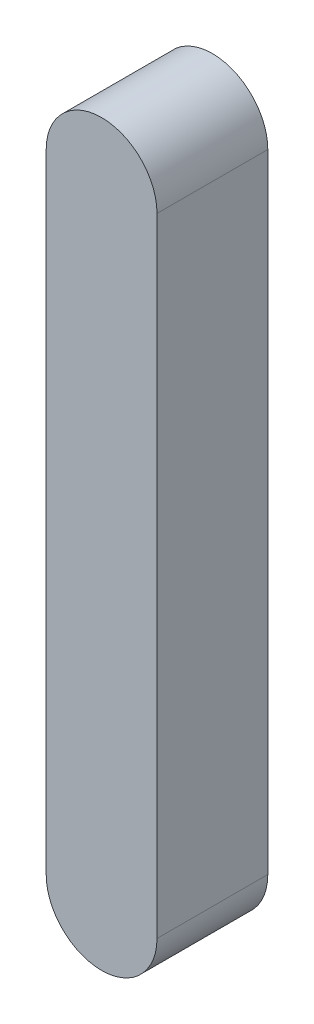
ISO-10303-21;
HEADER;
FILE_DESCRIPTION(('STEP AP214'),'2;1');
FILE_NAME('part.step','',(''),(''),'','','');
FILE_SCHEMA(('AUTOMOTIVE_DESIGN { 1 0 10303 214 1 1 1 1 }'));
ENDSEC;
DATA;
#1=APPLICATION_CONTEXT('core data for automotive mechanical design processes');
#2=APPLICATION_PROTOCOL_DEFINITION('international standard','automotive_design',2000,#1);
#3=PRODUCT_CONTEXT('',#1,'mechanical');
#4=PRODUCT('Part','Part','',(#3));
#5=PRODUCT_RELATED_PRODUCT_CATEGORY('part','',(#4));
#6=PRODUCT_DEFINITION_FORMATION('','',#4);
#7=PRODUCT_DEFINITION_CONTEXT('part definition',#1,'design');
#8=PRODUCT_DEFINITION('design','',#6,#7);
#9=PRODUCT_DEFINITION_SHAPE('','',#8);
#10=(LENGTH_UNIT() NAMED_UNIT(*) SI_UNIT(.MILLI.,.METRE.));
#11=(NAMED_UNIT(*) PLANE_ANGLE_UNIT() SI_UNIT($,.RADIAN.));
#12=(NAMED_UNIT(*) SI_UNIT($,.STERADIAN.) SOLID_ANGLE_UNIT());
#13=UNCERTAINTY_MEASURE_WITH_UNIT(LENGTH_MEASURE(1.E-05),#10,'distance_accuracy_value','');
#14=(GEOMETRIC_REPRESENTATION_CONTEXT(3) GLOBAL_UNCERTAINTY_ASSIGNED_CONTEXT((#13)) GLOBAL_UNIT_ASSIGNED_CONTEXT((#10,
#11,#12)) REPRESENTATION_CONTEXT('',''));
#15=CARTESIAN_POINT('',(0.,0.,0.));
#16=DIRECTION('',(0.,0.,1.));
#17=DIRECTION('',(1.,0.,0.));
#18=AXIS2_PLACEMENT_3D('',#15,#16,#17);
#19=CARTESIAN_POINT('',(80.2001568482512,56.8998914127491,6.));
#20=DIRECTION('',(1.,0.,0.));
#21=DIRECTION('',(0.,0.,-1.));
#22=AXIS2_PLACEMENT_3D('',#19,#20,#21);
#23=PLANE('',#22);
#24=DIRECTION('',(0.,-1.,0.));
#25=VECTOR('',#24,1.);
#26=CARTESIAN_POINT('',(80.2001568482512,56.8998914127491,0.));
#27=LINE('',#26,#25);
#28=CARTESIAN_POINT('',(80.2001568482512,56.8998914127491,0.));
#29=VERTEX_POINT('',#28);
#30=CARTESIAN_POINT('',(80.2001568482512,22.8998914127491,0.));
#31=VERTEX_POINT('',#30);
#32=EDGE_CURVE('E98',#29,#31,#27,.T.);
#33=ORIENTED_EDGE('',*,*,#32,.F.);
#34=DIRECTION('',(0.,0.,-1.));
#35=VECTOR('',#34,1.);
#36=CARTESIAN_POINT('',(80.2001568482512,56.8998914127491,6.));
#37=LINE('',#36,#35);
#38=CARTESIAN_POINT('',(80.2001568482512,56.8998914127491,6.));
#39=VERTEX_POINT('',#38);
#40=EDGE_CURVE('E11',#39,#29,#37,.T.);
#41=ORIENTED_EDGE('',*,*,#40,.F.);
#42=DIRECTION('',(0.,-1.,0.));
#43=VECTOR('',#42,1.);
#44=CARTESIAN_POINT('',(80.2001568482512,56.8998914127491,6.));
#45=LINE('',#44,#43);
#46=CARTESIAN_POINT('',(80.2001568482512,22.8998914127491,6.));
#47=VERTEX_POINT('',#46);
#48=EDGE_CURVE('E93',#39,#47,#45,.T.);
#49=ORIENTED_EDGE('',*,*,#48,.T.);
#50=DIRECTION('',(0.,0.,-1.));
#51=VECTOR('',#50,1.);
#52=CARTESIAN_POINT('',(80.2001568482512,22.8998914127491,6.));
#53=LINE('',#52,#51);
#54=EDGE_CURVE('E36',#47,#31,#53,.T.);
#55=ORIENTED_EDGE('',*,*,#54,.T.);
#56=EDGE_LOOP('',(#33,#41,#49,#55));
#57=FACE_BOUND('',#56,.T.);
#58=ADVANCED_FACE('F33',(#57),#23,.T.);
#59=CARTESIAN_POINT('',(77.2001568482512,56.8998914127491,6.));
#60=DIRECTION('',(0.,0.,-1.));
#61=DIRECTION('',(-1.,0.,0.));
#62=AXIS2_PLACEMENT_3D('',#59,#60,#61);
#63=CYLINDRICAL_SURFACE('',#62,2.99999999999999);
#64=CARTESIAN_POINT('',(77.2001568482512,56.8998914127491,0.));
#65=DIRECTION('',(0.,0.,1.));
#66=DIRECTION('',(1.,0.,0.));
#67=AXIS2_PLACEMENT_3D('',#64,#65,#66);
#68=CIRCLE('',#67,2.99999999999999);
#69=CARTESIAN_POINT('',(74.2001568482512,56.8998914127491,0.));
#70=VERTEX_POINT('',#69);
#71=EDGE_CURVE('E66',#29,#70,#68,.T.);
#72=ORIENTED_EDGE('',*,*,#71,.T.);
#73=DIRECTION('',(0.,0.,-1.));
#74=VECTOR('',#73,1.);
#75=CARTESIAN_POINT('',(74.2001568482512,56.8998914127491,6.));
#76=LINE('',#75,#74);
#77=CARTESIAN_POINT('',(74.2001568482512,56.8998914127491,6.));
#78=VERTEX_POINT('',#77);
#79=EDGE_CURVE('E42',#78,#70,#76,.T.);
#80=ORIENTED_EDGE('',*,*,#79,.F.);
#81=CARTESIAN_POINT('',(77.2001568482512,56.8998914127491,6.));
#82=DIRECTION('',(0.,0.,1.));
#83=DIRECTION('',(1.,0.,0.));
#84=AXIS2_PLACEMENT_3D('',#81,#82,#83);
#85=CIRCLE('',#84,2.99999999999999);
#86=EDGE_CURVE('E81',#39,#78,#85,.T.);
#87=ORIENTED_EDGE('',*,*,#86,.F.);
#88=ORIENTED_EDGE('',*,*,#40,.T.);
#89=EDGE_LOOP('',(#72,#80,#87,#88));
#90=FACE_BOUND('',#89,.T.);
#91=ADVANCED_FACE('F108',(#90),#63,.T.);
#92=CARTESIAN_POINT('',(74.2001568482512,56.8998914127491,6.));
#93=DIRECTION('',(1.,0.,0.));
#94=DIRECTION('',(0.,0.,-1.));
#95=AXIS2_PLACEMENT_3D('',#92,#93,#94);
#96=PLANE('',#95);
#97=DIRECTION('',(0.,-1.,0.));
#98=VECTOR('',#97,1.);
#99=CARTESIAN_POINT('',(74.2001568482512,56.8998914127491,0.));
#100=LINE('',#99,#98);
#101=CARTESIAN_POINT('',(74.2001568482512,22.8998914127491,0.));
#102=VERTEX_POINT('',#101);
#103=EDGE_CURVE('E88',#70,#102,#100,.T.);
#104=ORIENTED_EDGE('',*,*,#103,.T.);
#105=DIRECTION('',(0.,0.,-1.));
#106=VECTOR('',#105,1.);
#107=CARTESIAN_POINT('',(74.2001568482512,22.8998914127491,6.));
#108=LINE('',#107,#106);
#109=CARTESIAN_POINT('',(74.2001568482512,22.8998914127491,6.));
#110=VERTEX_POINT('',#109);
#111=EDGE_CURVE('E85',#110,#102,#108,.T.);
#112=ORIENTED_EDGE('',*,*,#111,.F.);
#113=DIRECTION('',(0.,-1.,0.));
#114=VECTOR('',#113,1.);
#115=CARTESIAN_POINT('',(74.2001568482512,56.8998914127491,6.));
#116=LINE('',#115,#114);
#117=EDGE_CURVE('E78',#78,#110,#116,.T.);
#118=ORIENTED_EDGE('',*,*,#117,.F.);
#119=ORIENTED_EDGE('',*,*,#79,.T.);
#120=EDGE_LOOP('',(#104,#112,#118,#119));
#121=FACE_BOUND('',#120,.T.);
#122=ADVANCED_FACE('F86',(#121),#96,.F.);
#123=CARTESIAN_POINT('',(77.2001568482512,22.8998914127491,6.));
#124=DIRECTION('',(0.,0.,-1.));
#125=DIRECTION('',(-1.,0.,0.));
#126=AXIS2_PLACEMENT_3D('',#123,#124,#125);
#127=CYLINDRICAL_SURFACE('',#126,2.99999999999999);
#128=CARTESIAN_POINT('',(77.2001568482512,22.8998914127491,0.));
#129=DIRECTION('',(0.,0.,1.));
#130=DIRECTION('',(1.,0.,0.));
#131=AXIS2_PLACEMENT_3D('',#128,#129,#130);
#132=CIRCLE('',#131,2.99999999999999);
#133=EDGE_CURVE('E101',#102,#31,#132,.T.);
#134=ORIENTED_EDGE('',*,*,#133,.T.);
#135=ORIENTED_EDGE('',*,*,#54,.F.);
#136=CARTESIAN_POINT('',(77.2001568482512,22.8998914127491,6.));
#137=DIRECTION('',(0.,0.,1.));
#138=DIRECTION('',(1.,0.,0.));
#139=AXIS2_PLACEMENT_3D('',#136,#137,#138);
#140=CIRCLE('',#139,2.99999999999999);
#141=EDGE_CURVE('E75',#110,#47,#140,.T.);
#142=ORIENTED_EDGE('',*,*,#141,.F.);
#143=ORIENTED_EDGE('',*,*,#111,.T.);
#144=EDGE_LOOP('',(#134,#135,#142,#143));
#145=FACE_BOUND('',#144,.T.);
#146=ADVANCED_FACE('F92',(#145),#127,.T.);
#147=CARTESIAN_POINT('',(77.2001568482512,22.8998914127491,6.));
#148=DIRECTION('',(0.,0.,1.));
#149=DIRECTION('',(1.,0.,0.));
#150=AXIS2_PLACEMENT_3D('',#147,#148,#149);
#151=PLANE('',#150);
#152=ORIENTED_EDGE('',*,*,#48,.F.);
#153=ORIENTED_EDGE('',*,*,#86,.T.);
#154=ORIENTED_EDGE('',*,*,#117,.T.);
#155=ORIENTED_EDGE('',*,*,#141,.T.);
#156=EDGE_LOOP('',(#152,#153,#154,#155));
#157=FACE_BOUND('',#156,.T.);
#158=ADVANCED_FACE('F80',(#157),#151,.T.);
#159=CARTESIAN_POINT('',(77.2001568482512,22.8998914127491,0.));
#160=DIRECTION('',(0.,0.,1.));
#161=DIRECTION('',(1.,0.,0.));
#162=AXIS2_PLACEMENT_3D('',#159,#160,#161);
#163=PLANE('',#162);
#164=ORIENTED_EDGE('',*,*,#32,.T.);
#165=ORIENTED_EDGE('',*,*,#133,.F.);
#166=ORIENTED_EDGE('',*,*,#103,.F.);
#167=ORIENTED_EDGE('',*,*,#71,.F.);
#168=EDGE_LOOP('',(#164,#165,#166,#167));
#169=FACE_BOUND('',#168,.T.);
#170=ADVANCED_FACE('F106',(#169),#163,.F.);
#171=CLOSED_SHELL('',(#58,#91,#122,#146,#158,#170));
#172=MANIFOLD_SOLID_BREP('B2',#171);
#173=ADVANCED_BREP_SHAPE_REPRESENTATION('',(#18,#172),#14);
#174=SHAPE_DEFINITION_REPRESENTATION(#9,#173);
ENDSEC;
END-ISO-10303-21;
